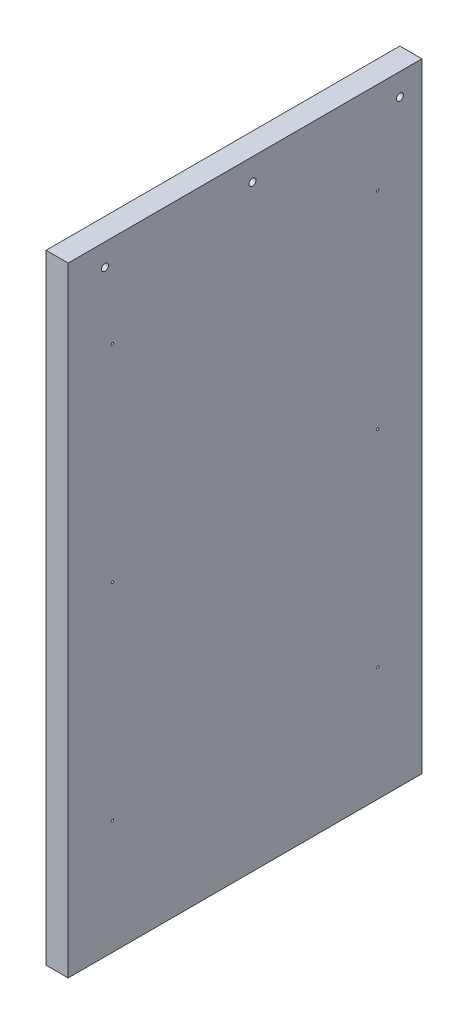
ISO-10303-21;
HEADER;
FILE_DESCRIPTION(('STEP AP214'),'2;1');
FILE_NAME('part.step','',(''),(''),'','','');
FILE_SCHEMA(('AUTOMOTIVE_DESIGN { 1 0 10303 214 1 1 1 1 }'));
ENDSEC;
DATA;
#1=APPLICATION_CONTEXT('core data for automotive mechanical design processes');
#2=APPLICATION_PROTOCOL_DEFINITION('international standard','automotive_design',2000,#1);
#3=PRODUCT_CONTEXT('',#1,'mechanical');
#4=PRODUCT('Part','Part','',(#3));
#5=PRODUCT_RELATED_PRODUCT_CATEGORY('part','',(#4));
#6=PRODUCT_DEFINITION_FORMATION('','',#4);
#7=PRODUCT_DEFINITION_CONTEXT('part definition',#1,'design');
#8=PRODUCT_DEFINITION('design','',#6,#7);
#9=PRODUCT_DEFINITION_SHAPE('','',#8);
#10=(LENGTH_UNIT() NAMED_UNIT(*) SI_UNIT(.MILLI.,.METRE.));
#11=(NAMED_UNIT(*) PLANE_ANGLE_UNIT() SI_UNIT($,.RADIAN.));
#12=(NAMED_UNIT(*) SI_UNIT($,.STERADIAN.) SOLID_ANGLE_UNIT());
#13=UNCERTAINTY_MEASURE_WITH_UNIT(LENGTH_MEASURE(1.E-05),#10,'distance_accuracy_value','');
#14=(GEOMETRIC_REPRESENTATION_CONTEXT(3) GLOBAL_UNCERTAINTY_ASSIGNED_CONTEXT((#13)) GLOBAL_UNIT_ASSIGNED_CONTEXT((#10,
#11,#12)) REPRESENTATION_CONTEXT('',''));
#15=CARTESIAN_POINT('',(0.,0.,0.));
#16=DIRECTION('',(0.,0.,1.));
#17=DIRECTION('',(1.,0.,0.));
#18=AXIS2_PLACEMENT_3D('',#15,#16,#17);
#19=CARTESIAN_POINT('',(312.42,0.,0.));
#20=DIRECTION('',(1.,0.,0.));
#21=DIRECTION('',(0.,0.,-1.));
#22=AXIS2_PLACEMENT_3D('',#19,#20,#21);
#23=PLANE('',#22);
#24=CARTESIAN_POINT('',(312.420000000001,5708.65000000001,3032.76));
#25=DIRECTION('',(-1.,0.,0.));
#26=DIRECTION('',(0.,0.,1.));
#27=AXIS2_PLACEMENT_3D('',#24,#25,#26);
#28=CIRCLE('',#27,2.9766259999997);
#29=CARTESIAN_POINT('',(312.420000000001,5708.65000000001,3035.736626));
#30=VERTEX_POINT('',#29);
#31=EDGE_CURVE('E322',#30,#30,#28,.T.);
#32=ORIENTED_EDGE('',*,*,#31,.T.);
#33=EDGE_LOOP('',(#32));
#34=FACE_BOUND('',#33,.T.);
#35=CARTESIAN_POINT('',(312.420000000002,5708.65000000001,2905.76));
#36=DIRECTION('',(-1.,0.,0.));
#37=DIRECTION('',(0.,0.,1.));
#38=AXIS2_PLACEMENT_3D('',#35,#36,#37);
#39=CIRCLE('',#38,2.9766259999997);
#40=CARTESIAN_POINT('',(312.420000000002,5708.65000000001,2908.736626));
#41=VERTEX_POINT('',#40);
#42=EDGE_CURVE('E332',#41,#41,#39,.T.);
#43=ORIENTED_EDGE('',*,*,#42,.T.);
#44=EDGE_LOOP('',(#43));
#45=FACE_BOUND('',#44,.T.);
#46=DIRECTION('',(0.,0.,-1.));
#47=VECTOR('',#46,1.);
#48=CARTESIAN_POINT('',(312.420000000001,5194.30000000001,3064.51));
#49=LINE('',#48,#47);
#50=CARTESIAN_POINT('',(312.420000000001,5194.30000000001,3064.51));
#51=VERTEX_POINT('',#50);
#52=CARTESIAN_POINT('',(312.42,5194.30000000001,2759.71));
#53=VERTEX_POINT('',#52);
#54=EDGE_CURVE('E117',#51,#53,#49,.T.);
#55=ORIENTED_EDGE('',*,*,#54,.T.);
#56=DIRECTION('',(0.,1.,0.));
#57=VECTOR('',#56,1.);
#58=CARTESIAN_POINT('',(312.42,5194.30000000001,2759.71));
#59=LINE('',#58,#57);
#60=CARTESIAN_POINT('',(312.42,5727.70000000001,2759.71));
#61=VERTEX_POINT('',#60);
#62=EDGE_CURVE('E114',#53,#61,#59,.T.);
#63=ORIENTED_EDGE('',*,*,#62,.T.);
#64=DIRECTION('',(0.,0.,1.));
#65=VECTOR('',#64,1.);
#66=CARTESIAN_POINT('',(312.42,5727.70000000001,2759.71));
#67=LINE('',#66,#65);
#68=CARTESIAN_POINT('',(312.42,5727.70000000001,3064.51));
#69=VERTEX_POINT('',#68);
#70=EDGE_CURVE('E111',#61,#69,#67,.T.);
#71=ORIENTED_EDGE('',*,*,#70,.T.);
#72=DIRECTION('',(0.,-1.,0.));
#73=VECTOR('',#72,1.);
#74=CARTESIAN_POINT('',(312.42,5727.70000000001,3064.51));
#75=LINE('',#74,#73);
#76=EDGE_CURVE('E113',#69,#51,#75,.T.);
#77=ORIENTED_EDGE('',*,*,#76,.T.);
#78=EDGE_LOOP('',(#55,#63,#71,#77));
#79=FACE_BOUND('',#78,.T.);
#80=CARTESIAN_POINT('',(312.420000000001,5292.725,3026.41));
#81=DIRECTION('',(1.,0.,0.));
#82=DIRECTION('',(0.,0.,-1.));
#83=AXIS2_PLACEMENT_3D('',#80,#81,#82);
#84=CIRCLE('',#83,0.991870000000006);
#85=CARTESIAN_POINT('',(312.420000000001,5292.725,3025.41813));
#86=VERTEX_POINT('',#85);
#87=EDGE_CURVE('E124',#86,#86,#84,.T.);
#88=ORIENTED_EDGE('',*,*,#87,.F.);
#89=EDGE_LOOP('',(#88));
#90=FACE_BOUND('',#89,.T.);
#91=CARTESIAN_POINT('',(312.420000000002,5292.72500000001,2797.81));
#92=DIRECTION('',(1.,0.,0.));
#93=DIRECTION('',(0.,0.,-1.));
#94=AXIS2_PLACEMENT_3D('',#91,#92,#93);
#95=CIRCLE('',#94,0.991870000000006);
#96=CARTESIAN_POINT('',(312.420000000002,5292.72500000001,2796.81813));
#97=VERTEX_POINT('',#96);
#98=EDGE_CURVE('E128',#97,#97,#95,.T.);
#99=ORIENTED_EDGE('',*,*,#98,.F.);
#100=EDGE_LOOP('',(#99));
#101=FACE_BOUND('',#100,.T.);
#102=CARTESIAN_POINT('',(312.420000000002,5470.52500000001,3026.41));
#103=DIRECTION('',(1.,0.,0.));
#104=DIRECTION('',(0.,0.,-1.));
#105=AXIS2_PLACEMENT_3D('',#102,#103,#104);
#106=CIRCLE('',#105,0.991870000000006);
#107=CARTESIAN_POINT('',(312.420000000002,5470.52500000001,3025.41813));
#108=VERTEX_POINT('',#107);
#109=EDGE_CURVE('E131',#108,#108,#106,.T.);
#110=ORIENTED_EDGE('',*,*,#109,.F.);
#111=EDGE_LOOP('',(#110));
#112=FACE_BOUND('',#111,.T.);
#113=CARTESIAN_POINT('',(312.42,5470.52500000001,2797.81));
#114=DIRECTION('',(1.,0.,0.));
#115=DIRECTION('',(0.,0.,-1.));
#116=AXIS2_PLACEMENT_3D('',#113,#114,#115);
#117=CIRCLE('',#116,0.991870000000006);
#118=CARTESIAN_POINT('',(312.42,5470.52500000001,2796.81813));
#119=VERTEX_POINT('',#118);
#120=EDGE_CURVE('E135',#119,#119,#117,.T.);
#121=ORIENTED_EDGE('',*,*,#120,.F.);
#122=EDGE_LOOP('',(#121));
#123=FACE_BOUND('',#122,.T.);
#124=CARTESIAN_POINT('',(312.419999999999,5648.32500000001,2797.81));
#125=DIRECTION('',(1.,0.,0.));
#126=DIRECTION('',(0.,0.,-1.));
#127=AXIS2_PLACEMENT_3D('',#124,#125,#126);
#128=CIRCLE('',#127,0.991870000000006);
#129=CARTESIAN_POINT('',(312.419999999999,5648.32500000001,2796.81813));
#130=VERTEX_POINT('',#129);
#131=EDGE_CURVE('E139',#130,#130,#128,.T.);
#132=ORIENTED_EDGE('',*,*,#131,.F.);
#133=EDGE_LOOP('',(#132));
#134=FACE_BOUND('',#133,.T.);
#135=CARTESIAN_POINT('',(312.420000000002,5648.32500000001,3026.41));
#136=DIRECTION('',(1.,0.,0.));
#137=DIRECTION('',(0.,0.,-1.));
#138=AXIS2_PLACEMENT_3D('',#135,#136,#137);
#139=CIRCLE('',#138,0.991870000000006);
#140=CARTESIAN_POINT('',(312.420000000002,5648.32500000001,3025.41813));
#141=VERTEX_POINT('',#140);
#142=EDGE_CURVE('E141',#141,#141,#139,.T.);
#143=ORIENTED_EDGE('',*,*,#142,.F.);
#144=EDGE_LOOP('',(#143));
#145=FACE_BOUND('',#144,.T.);
#146=CARTESIAN_POINT('',(312.42,5708.65,2778.76));
#147=DIRECTION('',(-1.,0.,0.));
#148=DIRECTION('',(0.,0.,1.));
#149=AXIS2_PLACEMENT_3D('',#146,#147,#148);
#150=CIRCLE('',#149,2.9766259999997);
#151=CARTESIAN_POINT('',(312.42,5708.65,2781.736626));
#152=VERTEX_POINT('',#151);
#153=EDGE_CURVE('E151',#152,#152,#150,.T.);
#154=ORIENTED_EDGE('',*,*,#153,.T.);
#155=EDGE_LOOP('',(#154));
#156=FACE_BOUND('',#155,.T.);
#157=ADVANCED_FACE('F50',(#34,#45,#79,#90,#101,#112,#123,#134,#145,#156),#23,.T.);
#158=CARTESIAN_POINT('',(292.100000000001,5727.70000000001,3064.51));
#159=DIRECTION('',(0.,0.,1.));
#160=DIRECTION('',(1.,0.,0.));
#161=AXIS2_PLACEMENT_3D('',#158,#159,#160);
#162=PLANE('',#161);
#163=DIRECTION('',(1.,0.,0.));
#164=VECTOR('',#163,1.);
#165=CARTESIAN_POINT('',(292.100000000001,5727.70000000001,3064.51));
#166=LINE('',#165,#164);
#167=CARTESIAN_POINT('',(293.370000000001,5727.70000000001,3064.51));
#168=VERTEX_POINT('',#167);
#169=EDGE_CURVE('E59',#168,#69,#166,.T.);
#170=ORIENTED_EDGE('',*,*,#169,.F.);
#171=DIRECTION('',(0.,1.,0.));
#172=VECTOR('',#171,1.);
#173=CARTESIAN_POINT('',(293.370000000001,5194.30000000001,3064.51));
#174=LINE('',#173,#172);
#175=CARTESIAN_POINT('',(293.370000000001,5194.30000000001,3064.51));
#176=VERTEX_POINT('',#175);
#177=EDGE_CURVE('E67',#176,#168,#174,.T.);
#178=ORIENTED_EDGE('',*,*,#177,.F.);
#179=DIRECTION('',(1.,0.,0.));
#180=VECTOR('',#179,1.);
#181=CARTESIAN_POINT('',(292.100000000001,5194.30000000001,3064.51));
#182=LINE('',#181,#180);
#183=EDGE_CURVE('E74',#51,#176,#182,.F.);
#184=ORIENTED_EDGE('',*,*,#183,.F.);
#185=ORIENTED_EDGE('',*,*,#76,.F.);
#186=EDGE_LOOP('',(#170,#178,#184,#185));
#187=FACE_BOUND('',#186,.T.);
#188=ADVANCED_FACE('F52',(#187),#162,.T.);
#189=CARTESIAN_POINT('',(292.100000000001,5194.30000000001,3064.51));
#190=DIRECTION('',(0.,-1.,0.));
#191=DIRECTION('',(0.,0.,-1.));
#192=AXIS2_PLACEMENT_3D('',#189,#190,#191);
#193=PLANE('',#192);
#194=ORIENTED_EDGE('',*,*,#183,.T.);
#195=DIRECTION('',(0.,0.,1.));
#196=VECTOR('',#195,1.);
#197=CARTESIAN_POINT('',(293.370000000001,5194.30000000001,2759.71));
#198=LINE('',#197,#196);
#199=CARTESIAN_POINT('',(293.370000000001,5194.30000000001,2759.71));
#200=VERTEX_POINT('',#199);
#201=EDGE_CURVE('E106',#200,#176,#198,.T.);
#202=ORIENTED_EDGE('',*,*,#201,.F.);
#203=DIRECTION('',(-1.,0.,0.));
#204=VECTOR('',#203,1.);
#205=CARTESIAN_POINT('',(292.1,5194.3,2759.71));
#206=LINE('',#205,#204);
#207=EDGE_CURVE('E105',#53,#200,#206,.T.);
#208=ORIENTED_EDGE('',*,*,#207,.F.);
#209=ORIENTED_EDGE('',*,*,#54,.F.);
#210=EDGE_LOOP('',(#194,#202,#208,#209));
#211=FACE_BOUND('',#210,.T.);
#212=ADVANCED_FACE('F168',(#211),#193,.T.);
#213=CARTESIAN_POINT('',(292.1,5194.3,2759.71));
#214=DIRECTION('',(0.,0.,-1.));
#215=DIRECTION('',(-1.,0.,0.));
#216=AXIS2_PLACEMENT_3D('',#213,#214,#215);
#217=PLANE('',#216);
#218=ORIENTED_EDGE('',*,*,#207,.T.);
#219=DIRECTION('',(0.,-1.,0.));
#220=VECTOR('',#219,1.);
#221=CARTESIAN_POINT('',(293.369999999999,5727.70000000001,2759.71));
#222=LINE('',#221,#220);
#223=CARTESIAN_POINT('',(293.369999999999,5727.70000000001,2759.71));
#224=VERTEX_POINT('',#223);
#225=EDGE_CURVE('E94',#224,#200,#222,.T.);
#226=ORIENTED_EDGE('',*,*,#225,.F.);
#227=DIRECTION('',(1.,0.,0.));
#228=VECTOR('',#227,1.);
#229=CARTESIAN_POINT('',(292.100000000001,5727.70000000001,2759.71));
#230=LINE('',#229,#228);
#231=EDGE_CURVE('E13',#61,#224,#230,.F.);
#232=ORIENTED_EDGE('',*,*,#231,.F.);
#233=ORIENTED_EDGE('',*,*,#62,.F.);
#234=EDGE_LOOP('',(#218,#226,#232,#233));
#235=FACE_BOUND('',#234,.T.);
#236=ADVANCED_FACE('F102',(#235),#217,.T.);
#237=CARTESIAN_POINT('',(292.100000000001,5727.70000000001,2759.71));
#238=DIRECTION('',(0.,1.,0.));
#239=DIRECTION('',(0.,0.,1.));
#240=AXIS2_PLACEMENT_3D('',#237,#238,#239);
#241=PLANE('',#240);
#242=ORIENTED_EDGE('',*,*,#231,.T.);
#243=DIRECTION('',(0.,0.,-1.));
#244=VECTOR('',#243,1.);
#245=CARTESIAN_POINT('',(293.370000000001,5727.70000000001,3064.51));
#246=LINE('',#245,#244);
#247=EDGE_CURVE('E91',#168,#224,#246,.T.);
#248=ORIENTED_EDGE('',*,*,#247,.F.);
#249=ORIENTED_EDGE('',*,*,#169,.T.);
#250=ORIENTED_EDGE('',*,*,#70,.F.);
#251=EDGE_LOOP('',(#242,#248,#249,#250));
#252=FACE_BOUND('',#251,.T.);
#253=ADVANCED_FACE('F109',(#252),#241,.T.);
#254=CARTESIAN_POINT('',(293.37,1.77635683940025E-12,8.88178419700125E-13));
#255=DIRECTION('',(-1.,0.,0.));
#256=DIRECTION('',(0.,-1.,0.));
#257=AXIS2_PLACEMENT_3D('',#254,#255,#256);
#258=PLANE('',#257);
#259=CARTESIAN_POINT('',(293.370000000003,5708.65000000001,3032.76));
#260=DIRECTION('',(-1.,0.,0.));
#261=DIRECTION('',(0.,0.,1.));
#262=AXIS2_PLACEMENT_3D('',#259,#260,#261);
#263=CIRCLE('',#262,2.9766259999997);
#264=CARTESIAN_POINT('',(293.370000000003,5708.65000000001,3035.736626));
#265=VERTEX_POINT('',#264);
#266=EDGE_CURVE('E325',#265,#265,#263,.T.);
#267=ORIENTED_EDGE('',*,*,#266,.F.);
#268=EDGE_LOOP('',(#267));
#269=FACE_BOUND('',#268,.T.);
#270=CARTESIAN_POINT('',(293.37,5708.65000000001,2905.76));
#271=DIRECTION('',(-1.,0.,0.));
#272=DIRECTION('',(0.,0.,1.));
#273=AXIS2_PLACEMENT_3D('',#270,#271,#272);
#274=CIRCLE('',#273,2.9766259999997);
#275=CARTESIAN_POINT('',(293.37,5708.65000000001,2908.736626));
#276=VERTEX_POINT('',#275);
#277=EDGE_CURVE('E327',#276,#276,#274,.T.);
#278=ORIENTED_EDGE('',*,*,#277,.F.);
#279=EDGE_LOOP('',(#278));
#280=FACE_BOUND('',#279,.T.);
#281=CARTESIAN_POINT('',(293.369999999999,5708.65,2778.76));
#282=DIRECTION('',(-1.,0.,0.));
#283=DIRECTION('',(0.,0.,1.));
#284=AXIS2_PLACEMENT_3D('',#281,#282,#283);
#285=CIRCLE('',#284,2.9766259999997);
#286=CARTESIAN_POINT('',(293.369999999999,5708.65,2781.736626));
#287=VERTEX_POINT('',#286);
#288=EDGE_CURVE('E334',#287,#287,#285,.T.);
#289=ORIENTED_EDGE('',*,*,#288,.F.);
#290=EDGE_LOOP('',(#289));
#291=FACE_BOUND('',#290,.T.);
#292=CARTESIAN_POINT('',(293.37,5648.32500000001,3026.41));
#293=DIRECTION('',(-1.,0.,0.));
#294=DIRECTION('',(0.,-1.,0.));
#295=AXIS2_PLACEMENT_3D('',#292,#293,#294);
#296=CIRCLE('',#295,0.991870000000006);
#297=CARTESIAN_POINT('',(293.37,5647.33313000001,3026.41));
#298=VERTEX_POINT('',#297);
#299=EDGE_CURVE('E54',#298,#298,#296,.T.);
#300=ORIENTED_EDGE('',*,*,#299,.F.);
#301=EDGE_LOOP('',(#300));
#302=FACE_BOUND('',#301,.T.);
#303=CARTESIAN_POINT('',(293.369999999999,5648.325,2797.81));
#304=DIRECTION('',(-1.,0.,0.));
#305=DIRECTION('',(0.,-1.,0.));
#306=AXIS2_PLACEMENT_3D('',#303,#304,#305);
#307=CIRCLE('',#306,0.991870000000006);
#308=CARTESIAN_POINT('',(293.369999999999,5647.33313,2797.81));
#309=VERTEX_POINT('',#308);
#310=EDGE_CURVE('E138',#309,#309,#307,.T.);
#311=ORIENTED_EDGE('',*,*,#310,.F.);
#312=EDGE_LOOP('',(#311));
#313=FACE_BOUND('',#312,.T.);
#314=CARTESIAN_POINT('',(293.37,5470.52500000001,2797.81));
#315=DIRECTION('',(-1.,0.,0.));
#316=DIRECTION('',(0.,-1.,0.));
#317=AXIS2_PLACEMENT_3D('',#314,#315,#316);
#318=CIRCLE('',#317,0.991870000000006);
#319=CARTESIAN_POINT('',(293.37,5469.53313000001,2797.81));
#320=VERTEX_POINT('',#319);
#321=EDGE_CURVE('E136',#320,#320,#318,.T.);
#322=ORIENTED_EDGE('',*,*,#321,.F.);
#323=EDGE_LOOP('',(#322));
#324=FACE_BOUND('',#323,.T.);
#325=CARTESIAN_POINT('',(293.370000000001,5470.52500000001,3026.41));
#326=DIRECTION('',(-1.,0.,0.));
#327=DIRECTION('',(0.,-1.,0.));
#328=AXIS2_PLACEMENT_3D('',#325,#326,#327);
#329=CIRCLE('',#328,0.991870000000006);
#330=CARTESIAN_POINT('',(293.370000000001,5469.53313000001,3026.41));
#331=VERTEX_POINT('',#330);
#332=EDGE_CURVE('E132',#331,#331,#329,.T.);
#333=ORIENTED_EDGE('',*,*,#332,.F.);
#334=EDGE_LOOP('',(#333));
#335=FACE_BOUND('',#334,.T.);
#336=CARTESIAN_POINT('',(293.370000000002,5292.72500000001,2797.81));
#337=DIRECTION('',(-1.,0.,0.));
#338=DIRECTION('',(0.,-1.,0.));
#339=AXIS2_PLACEMENT_3D('',#336,#337,#338);
#340=CIRCLE('',#339,0.991870000000006);
#341=CARTESIAN_POINT('',(293.370000000002,5291.73313000001,2797.81));
#342=VERTEX_POINT('',#341);
#343=EDGE_CURVE('E127',#342,#342,#340,.T.);
#344=ORIENTED_EDGE('',*,*,#343,.F.);
#345=EDGE_LOOP('',(#344));
#346=FACE_BOUND('',#345,.T.);
#347=CARTESIAN_POINT('',(293.369999999999,5292.72500000001,3026.41));
#348=DIRECTION('',(-1.,0.,0.));
#349=DIRECTION('',(0.,-1.,0.));
#350=AXIS2_PLACEMENT_3D('',#347,#348,#349);
#351=CIRCLE('',#350,0.991870000000006);
#352=CARTESIAN_POINT('',(293.369999999999,5291.73313000001,3026.41));
#353=VERTEX_POINT('',#352);
#354=EDGE_CURVE('E98',#353,#353,#351,.T.);
#355=ORIENTED_EDGE('',*,*,#354,.F.);
#356=EDGE_LOOP('',(#355));
#357=FACE_BOUND('',#356,.T.);
#358=ORIENTED_EDGE('',*,*,#247,.T.);
#359=ORIENTED_EDGE('',*,*,#225,.T.);
#360=ORIENTED_EDGE('',*,*,#201,.T.);
#361=ORIENTED_EDGE('',*,*,#177,.T.);
#362=EDGE_LOOP('',(#358,#359,#360,#361));
#363=FACE_BOUND('',#362,.T.);
#364=ADVANCED_FACE('F93',(#269,#280,#291,#302,#313,#324,#335,#346,#357,#363),#258,.T.);
#365=CARTESIAN_POINT('',(325.12,5292.725,3026.41));
#366=DIRECTION('',(1.,0.,0.));
#367=DIRECTION('',(0.,0.,-1.));
#368=AXIS2_PLACEMENT_3D('',#365,#366,#367);
#369=CYLINDRICAL_SURFACE('',#368,0.991870000000006);
#370=ORIENTED_EDGE('',*,*,#354,.T.);
#371=EDGE_LOOP('',(#370));
#372=FACE_BOUND('',#371,.T.);
#373=ORIENTED_EDGE('',*,*,#87,.T.);
#374=EDGE_LOOP('',(#373));
#375=FACE_BOUND('',#374,.T.);
#376=ADVANCED_FACE('F200',(#372,#375),#369,.F.);
#377=CARTESIAN_POINT('',(325.120000000001,5292.72500000001,2797.81));
#378=DIRECTION('',(1.,0.,0.));
#379=DIRECTION('',(0.,0.,-1.));
#380=AXIS2_PLACEMENT_3D('',#377,#378,#379);
#381=CYLINDRICAL_SURFACE('',#380,0.991870000000006);
#382=ORIENTED_EDGE('',*,*,#343,.T.);
#383=EDGE_LOOP('',(#382));
#384=FACE_BOUND('',#383,.T.);
#385=ORIENTED_EDGE('',*,*,#98,.T.);
#386=EDGE_LOOP('',(#385));
#387=FACE_BOUND('',#386,.T.);
#388=ADVANCED_FACE('F207',(#384,#387),#381,.F.);
#389=CARTESIAN_POINT('',(325.120000000001,5470.52500000001,3026.41));
#390=DIRECTION('',(1.,0.,0.));
#391=DIRECTION('',(0.,0.,-1.));
#392=AXIS2_PLACEMENT_3D('',#389,#390,#391);
#393=CYLINDRICAL_SURFACE('',#392,0.991870000000006);
#394=ORIENTED_EDGE('',*,*,#109,.T.);
#395=EDGE_LOOP('',(#394));
#396=FACE_BOUND('',#395,.T.);
#397=ORIENTED_EDGE('',*,*,#332,.T.);
#398=EDGE_LOOP('',(#397));
#399=FACE_BOUND('',#398,.T.);
#400=ADVANCED_FACE('F214',(#396,#399),#393,.F.);
#401=CARTESIAN_POINT('',(325.12,5470.52500000001,2797.81));
#402=DIRECTION('',(1.,0.,0.));
#403=DIRECTION('',(0.,0.,-1.));
#404=AXIS2_PLACEMENT_3D('',#401,#402,#403);
#405=CYLINDRICAL_SURFACE('',#404,0.991870000000006);
#406=ORIENTED_EDGE('',*,*,#120,.T.);
#407=EDGE_LOOP('',(#406));
#408=FACE_BOUND('',#407,.T.);
#409=ORIENTED_EDGE('',*,*,#321,.T.);
#410=EDGE_LOOP('',(#409));
#411=FACE_BOUND('',#410,.T.);
#412=ADVANCED_FACE('F222',(#408,#411),#405,.F.);
#413=CARTESIAN_POINT('',(325.12,5648.325,2797.81));
#414=DIRECTION('',(1.,0.,0.));
#415=DIRECTION('',(0.,0.,-1.));
#416=AXIS2_PLACEMENT_3D('',#413,#414,#415);
#417=CYLINDRICAL_SURFACE('',#416,0.991870000000006);
#418=ORIENTED_EDGE('',*,*,#310,.T.);
#419=EDGE_LOOP('',(#418));
#420=FACE_BOUND('',#419,.T.);
#421=ORIENTED_EDGE('',*,*,#131,.T.);
#422=EDGE_LOOP('',(#421));
#423=FACE_BOUND('',#422,.T.);
#424=ADVANCED_FACE('F230',(#420,#423),#417,.F.);
#425=CARTESIAN_POINT('',(325.120000000002,5648.325,3026.41));
#426=DIRECTION('',(1.,0.,0.));
#427=DIRECTION('',(0.,0.,-1.));
#428=AXIS2_PLACEMENT_3D('',#425,#426,#427);
#429=CYLINDRICAL_SURFACE('',#428,0.991870000000006);
#430=ORIENTED_EDGE('',*,*,#142,.T.);
#431=EDGE_LOOP('',(#430));
#432=FACE_BOUND('',#431,.T.);
#433=ORIENTED_EDGE('',*,*,#299,.T.);
#434=EDGE_LOOP('',(#433));
#435=FACE_BOUND('',#434,.T.);
#436=ADVANCED_FACE('F238',(#432,#435),#429,.F.);
#437=CARTESIAN_POINT('',(293.369999999999,5708.65,2778.76));
#438=DIRECTION('',(-1.,0.,0.));
#439=DIRECTION('',(0.,0.,1.));
#440=AXIS2_PLACEMENT_3D('',#437,#438,#439);
#441=CYLINDRICAL_SURFACE('',#440,2.9766259999997);
#442=ORIENTED_EDGE('',*,*,#153,.F.);
#443=EDGE_LOOP('',(#442));
#444=FACE_BOUND('',#443,.T.);
#445=ORIENTED_EDGE('',*,*,#288,.T.);
#446=EDGE_LOOP('',(#445));
#447=FACE_BOUND('',#446,.T.);
#448=ADVANCED_FACE('F246',(#444,#447),#441,.F.);
#449=CARTESIAN_POINT('',(293.37,5708.65000000001,2905.76));
#450=DIRECTION('',(-1.,0.,0.));
#451=DIRECTION('',(0.,0.,1.));
#452=AXIS2_PLACEMENT_3D('',#449,#450,#451);
#453=CYLINDRICAL_SURFACE('',#452,2.9766259999997);
#454=ORIENTED_EDGE('',*,*,#42,.F.);
#455=EDGE_LOOP('',(#454));
#456=FACE_BOUND('',#455,.T.);
#457=ORIENTED_EDGE('',*,*,#277,.T.);
#458=EDGE_LOOP('',(#457));
#459=FACE_BOUND('',#458,.T.);
#460=ADVANCED_FACE('F253',(#456,#459),#453,.F.);
#461=CARTESIAN_POINT('',(293.370000000003,5708.65000000001,3032.76));
#462=DIRECTION('',(-1.,0.,0.));
#463=DIRECTION('',(0.,0.,1.));
#464=AXIS2_PLACEMENT_3D('',#461,#462,#463);
#465=CYLINDRICAL_SURFACE('',#464,2.9766259999997);
#466=ORIENTED_EDGE('',*,*,#31,.F.);
#467=EDGE_LOOP('',(#466));
#468=FACE_BOUND('',#467,.T.);
#469=ORIENTED_EDGE('',*,*,#266,.T.);
#470=EDGE_LOOP('',(#469));
#471=FACE_BOUND('',#470,.T.);
#472=ADVANCED_FACE('F261',(#468,#471),#465,.F.);
#473=CLOSED_SHELL('',(#157,#188,#212,#236,#253,#364,#376,#388,#400,#412,#424,#436,#448,#460,#472));
#474=MANIFOLD_SOLID_BREP('B2',#473);
#475=ADVANCED_BREP_SHAPE_REPRESENTATION('',(#18,#474),#14);
#476=SHAPE_DEFINITION_REPRESENTATION(#9,#475);
ENDSEC;
END-ISO-10303-21;
